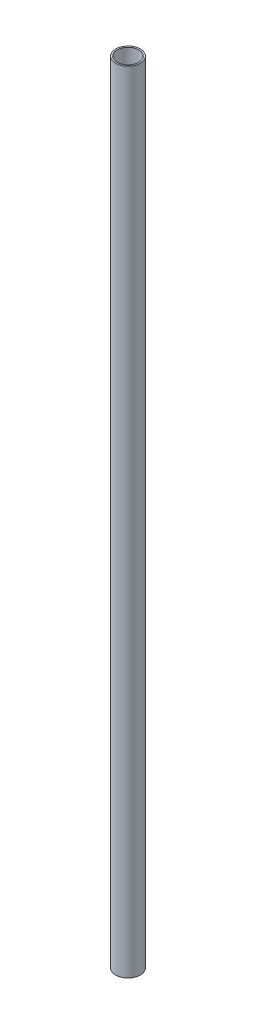
ISO-10303-21;
HEADER;
FILE_DESCRIPTION(('STEP AP214'),'2;1');
FILE_NAME('part.step','',(''),(''),'','','');
FILE_SCHEMA(('AUTOMOTIVE_DESIGN { 1 0 10303 214 1 1 1 1 }'));
ENDSEC;
DATA;
#1=APPLICATION_CONTEXT('core data for automotive mechanical design processes');
#2=APPLICATION_PROTOCOL_DEFINITION('international standard','automotive_design',2000,#1);
#3=PRODUCT_CONTEXT('',#1,'mechanical');
#4=PRODUCT('Part','Part','',(#3));
#5=PRODUCT_RELATED_PRODUCT_CATEGORY('part','',(#4));
#6=PRODUCT_DEFINITION_FORMATION('','',#4);
#7=PRODUCT_DEFINITION_CONTEXT('part definition',#1,'design');
#8=PRODUCT_DEFINITION('design','',#6,#7);
#9=PRODUCT_DEFINITION_SHAPE('','',#8);
#10=(LENGTH_UNIT() NAMED_UNIT(*) SI_UNIT(.MILLI.,.METRE.));
#11=(NAMED_UNIT(*) PLANE_ANGLE_UNIT() SI_UNIT($,.RADIAN.));
#12=(NAMED_UNIT(*) SI_UNIT($,.STERADIAN.) SOLID_ANGLE_UNIT());
#13=UNCERTAINTY_MEASURE_WITH_UNIT(LENGTH_MEASURE(1.E-05),#10,'distance_accuracy_value','');
#14=(GEOMETRIC_REPRESENTATION_CONTEXT(3) GLOBAL_UNCERTAINTY_ASSIGNED_CONTEXT((#13)) GLOBAL_UNIT_ASSIGNED_CONTEXT((#10,
#11,#12)) REPRESENTATION_CONTEXT('',''));
#15=CARTESIAN_POINT('',(0.,0.,0.));
#16=DIRECTION('',(0.,0.,1.));
#17=DIRECTION('',(1.,0.,0.));
#18=AXIS2_PLACEMENT_3D('',#15,#16,#17);
#19=CARTESIAN_POINT('',(0.,406.4,0.));
#20=DIRECTION('',(0.,1.,0.));
#21=DIRECTION('',(0.,0.,1.));
#22=AXIS2_PLACEMENT_3D('',#19,#20,#21);
#23=PLANE('',#22);
#24=CARTESIAN_POINT('',(0.,406.4,0.));
#25=DIRECTION('',(0.,1.,0.));
#26=DIRECTION('',(0.,0.,1.));
#27=AXIS2_PLACEMENT_3D('',#24,#25,#26);
#28=CIRCLE('',#27,12.7);
#29=CARTESIAN_POINT('',(0.,406.4,12.7));
#30=VERTEX_POINT('',#29);
#31=EDGE_CURVE('E10',#30,#30,#28,.T.);
#32=ORIENTED_EDGE('',*,*,#31,.T.);
#33=EDGE_LOOP('',(#32));
#34=FACE_BOUND('',#33,.T.);
#35=CARTESIAN_POINT('',(0.,406.4,0.));
#36=DIRECTION('',(0.,1.,0.));
#37=DIRECTION('',(0.,0.,1.));
#38=AXIS2_PLACEMENT_3D('',#35,#36,#37);
#39=CIRCLE('',#38,11.1125);
#40=CARTESIAN_POINT('',(0.,406.4,11.1125));
#41=VERTEX_POINT('',#40);
#42=EDGE_CURVE('E42',#41,#41,#39,.T.);
#43=ORIENTED_EDGE('',*,*,#42,.F.);
#44=EDGE_LOOP('',(#43));
#45=FACE_BOUND('',#44,.T.);
#46=ADVANCED_FACE('F31',(#34,#45),#23,.T.);
#47=CARTESIAN_POINT('',(0.,-406.4,0.));
#48=DIRECTION('',(0.,1.,0.));
#49=DIRECTION('',(0.,0.,1.));
#50=AXIS2_PLACEMENT_3D('',#47,#48,#49);
#51=PLANE('',#50);
#52=CARTESIAN_POINT('',(0.,-406.4,0.));
#53=DIRECTION('',(0.,1.,0.));
#54=DIRECTION('',(0.,0.,1.));
#55=AXIS2_PLACEMENT_3D('',#52,#53,#54);
#56=CIRCLE('',#55,12.7);
#57=CARTESIAN_POINT('',(0.,-406.4,12.7));
#58=VERTEX_POINT('',#57);
#59=EDGE_CURVE('E38',#58,#58,#56,.T.);
#60=ORIENTED_EDGE('',*,*,#59,.F.);
#61=EDGE_LOOP('',(#60));
#62=FACE_BOUND('',#61,.T.);
#63=CARTESIAN_POINT('',(0.,-406.4,0.));
#64=DIRECTION('',(0.,1.,0.));
#65=DIRECTION('',(0.,0.,1.));
#66=AXIS2_PLACEMENT_3D('',#63,#64,#65);
#67=CIRCLE('',#66,11.1125);
#68=CARTESIAN_POINT('',(0.,-406.4,11.1125));
#69=VERTEX_POINT('',#68);
#70=EDGE_CURVE('E46',#69,#69,#67,.T.);
#71=ORIENTED_EDGE('',*,*,#70,.T.);
#72=EDGE_LOOP('',(#71));
#73=FACE_BOUND('',#72,.T.);
#74=ADVANCED_FACE('F52',(#62,#73),#51,.F.);
#75=CARTESIAN_POINT('',(0.,406.4,0.));
#76=DIRECTION('',(0.,-1.,0.));
#77=DIRECTION('',(0.,0.,-1.));
#78=AXIS2_PLACEMENT_3D('',#75,#76,#77);
#79=CYLINDRICAL_SURFACE('',#78,12.7);
#80=ORIENTED_EDGE('',*,*,#31,.F.);
#81=EDGE_LOOP('',(#80));
#82=FACE_BOUND('',#81,.T.);
#83=ORIENTED_EDGE('',*,*,#59,.T.);
#84=EDGE_LOOP('',(#83));
#85=FACE_BOUND('',#84,.T.);
#86=ADVANCED_FACE('F33',(#82,#85),#79,.T.);
#87=CARTESIAN_POINT('',(0.,406.4,0.));
#88=DIRECTION('',(0.,-1.,0.));
#89=DIRECTION('',(0.,0.,-1.));
#90=AXIS2_PLACEMENT_3D('',#87,#88,#89);
#91=CYLINDRICAL_SURFACE('',#90,11.1125);
#92=ORIENTED_EDGE('',*,*,#42,.T.);
#93=EDGE_LOOP('',(#92));
#94=FACE_BOUND('',#93,.T.);
#95=ORIENTED_EDGE('',*,*,#70,.F.);
#96=EDGE_LOOP('',(#95));
#97=FACE_BOUND('',#96,.T.);
#98=ADVANCED_FACE('F54',(#94,#97),#91,.F.);
#99=CLOSED_SHELL('',(#46,#74,#86,#98));
#100=MANIFOLD_SOLID_BREP('B2',#99);
#101=ADVANCED_BREP_SHAPE_REPRESENTATION('',(#18,#100),#14);
#102=SHAPE_DEFINITION_REPRESENTATION(#9,#101);
ENDSEC;
END-ISO-10303-21;
